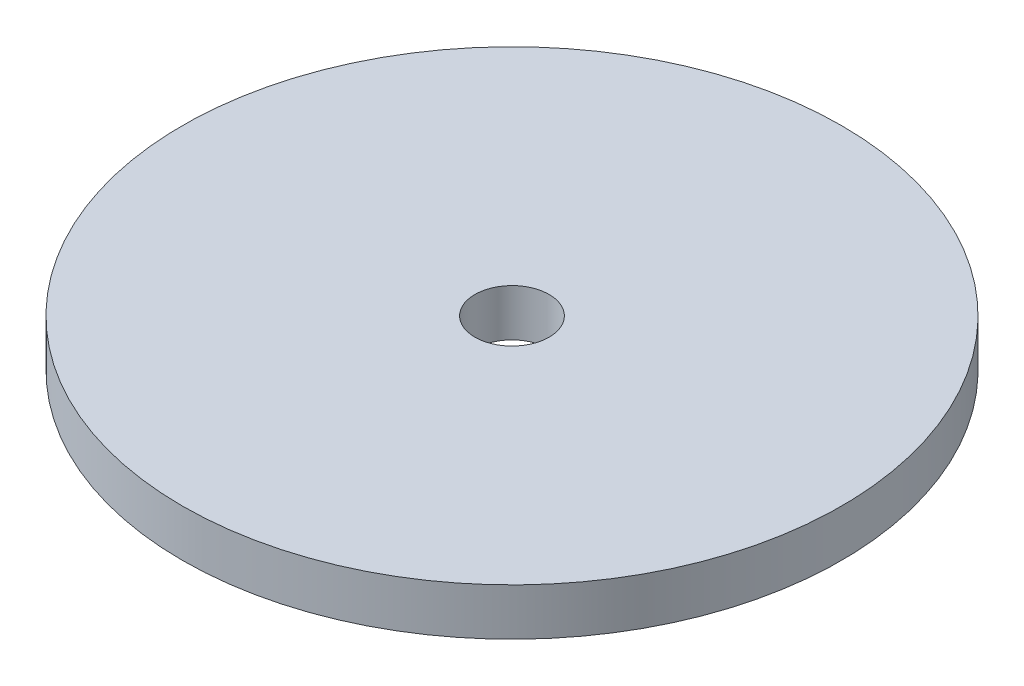
ISO-10303-21;
HEADER;
FILE_DESCRIPTION(('STEP AP214'),'2;1');
FILE_NAME('part.step','',(''),(''),'','','');
FILE_SCHEMA(('AUTOMOTIVE_DESIGN { 1 0 10303 214 1 1 1 1 }'));
ENDSEC;
DATA;
#1=APPLICATION_CONTEXT('core data for automotive mechanical design processes');
#2=APPLICATION_PROTOCOL_DEFINITION('international standard','automotive_design',2000,#1);
#3=PRODUCT_CONTEXT('',#1,'mechanical');
#4=PRODUCT('Part','Part','',(#3));
#5=PRODUCT_RELATED_PRODUCT_CATEGORY('part','',(#4));
#6=PRODUCT_DEFINITION_FORMATION('','',#4);
#7=PRODUCT_DEFINITION_CONTEXT('part definition',#1,'design');
#8=PRODUCT_DEFINITION('design','',#6,#7);
#9=PRODUCT_DEFINITION_SHAPE('','',#8);
#10=(LENGTH_UNIT() NAMED_UNIT(*) SI_UNIT(.MILLI.,.METRE.));
#11=(NAMED_UNIT(*) PLANE_ANGLE_UNIT() SI_UNIT($,.RADIAN.));
#12=(NAMED_UNIT(*) SI_UNIT($,.STERADIAN.) SOLID_ANGLE_UNIT());
#13=UNCERTAINTY_MEASURE_WITH_UNIT(LENGTH_MEASURE(1.E-05),#10,'distance_accuracy_value','');
#14=(GEOMETRIC_REPRESENTATION_CONTEXT(3) GLOBAL_UNCERTAINTY_ASSIGNED_CONTEXT((#13)) GLOBAL_UNIT_ASSIGNED_CONTEXT((#10,
#11,#12)) REPRESENTATION_CONTEXT('',''));
#15=CARTESIAN_POINT('',(0.,0.,0.));
#16=DIRECTION('',(0.,0.,1.));
#17=DIRECTION('',(1.,0.,0.));
#18=AXIS2_PLACEMENT_3D('',#15,#16,#17);
#19=CARTESIAN_POINT('',(0.,6.35,0.));
#20=DIRECTION('',(0.,1.,0.));
#21=DIRECTION('',(0.,0.,1.));
#22=AXIS2_PLACEMENT_3D('',#19,#20,#21);
#23=PLANE('',#22);
#24=CARTESIAN_POINT('',(0.,6.35,0.));
#25=DIRECTION('',(0.,1.,0.));
#26=DIRECTION('',(0.,0.,1.));
#27=AXIS2_PLACEMENT_3D('',#24,#25,#26);
#28=CIRCLE('',#27,44.45);
#29=CARTESIAN_POINT('',(0.,6.35,44.45));
#30=VERTEX_POINT('',#29);
#31=EDGE_CURVE('E10',#30,#30,#28,.T.);
#32=ORIENTED_EDGE('',*,*,#31,.T.);
#33=EDGE_LOOP('',(#32));
#34=FACE_BOUND('',#33,.T.);
#35=CARTESIAN_POINT('',(0.,6.35,0.));
#36=DIRECTION('',(0.,1.,0.));
#37=DIRECTION('',(0.,0.,1.));
#38=AXIS2_PLACEMENT_3D('',#35,#36,#37);
#39=CIRCLE('',#38,5.);
#40=CARTESIAN_POINT('',(0.,6.35,5.));
#41=VERTEX_POINT('',#40);
#42=EDGE_CURVE('E53',#41,#41,#39,.T.);
#43=ORIENTED_EDGE('',*,*,#42,.F.);
#44=EDGE_LOOP('',(#43));
#45=FACE_BOUND('',#44,.T.);
#46=ADVANCED_FACE('F39',(#34,#45),#23,.T.);
#47=CARTESIAN_POINT('',(0.,0.,0.));
#48=DIRECTION('',(0.,1.,0.));
#49=DIRECTION('',(0.,0.,1.));
#50=AXIS2_PLACEMENT_3D('',#47,#48,#49);
#51=PLANE('',#50);
#52=CARTESIAN_POINT('',(0.,0.,0.));
#53=DIRECTION('',(0.,1.,0.));
#54=DIRECTION('',(0.,0.,1.));
#55=AXIS2_PLACEMENT_3D('',#52,#53,#54);
#56=CIRCLE('',#55,44.45);
#57=CARTESIAN_POINT('',(0.,0.,44.45));
#58=VERTEX_POINT('',#57);
#59=EDGE_CURVE('E43',#58,#58,#56,.T.);
#60=ORIENTED_EDGE('',*,*,#59,.F.);
#61=EDGE_LOOP('',(#60));
#62=FACE_BOUND('',#61,.T.);
#63=CARTESIAN_POINT('',(0.,0.,0.));
#64=DIRECTION('',(0.,1.,0.));
#65=DIRECTION('',(0.,0.,1.));
#66=AXIS2_PLACEMENT_3D('',#63,#64,#65);
#67=CIRCLE('',#66,5.);
#68=CARTESIAN_POINT('',(0.,0.,5.));
#69=VERTEX_POINT('',#68);
#70=EDGE_CURVE('E55',#69,#69,#67,.T.);
#71=ORIENTED_EDGE('',*,*,#70,.T.);
#72=EDGE_LOOP('',(#71));
#73=FACE_BOUND('',#72,.T.);
#74=ADVANCED_FACE('F66',(#62,#73),#51,.F.);
#75=CARTESIAN_POINT('',(0.,6.35,0.));
#76=DIRECTION('',(0.,-1.,0.));
#77=DIRECTION('',(0.,0.,-1.));
#78=AXIS2_PLACEMENT_3D('',#75,#76,#77);
#79=CYLINDRICAL_SURFACE('',#78,44.45);
#80=ORIENTED_EDGE('',*,*,#31,.F.);
#81=EDGE_LOOP('',(#80));
#82=FACE_BOUND('',#81,.T.);
#83=ORIENTED_EDGE('',*,*,#59,.T.);
#84=EDGE_LOOP('',(#83));
#85=FACE_BOUND('',#84,.T.);
#86=ADVANCED_FACE('F41',(#82,#85),#79,.T.);
#87=CARTESIAN_POINT('',(0.,6.35,0.));
#88=DIRECTION('',(0.,-1.,0.));
#89=DIRECTION('',(0.,0.,-1.));
#90=AXIS2_PLACEMENT_3D('',#87,#88,#89);
#91=CYLINDRICAL_SURFACE('',#90,5.);
#92=ORIENTED_EDGE('',*,*,#42,.T.);
#93=EDGE_LOOP('',(#92));
#94=FACE_BOUND('',#93,.T.);
#95=ORIENTED_EDGE('',*,*,#70,.F.);
#96=EDGE_LOOP('',(#95));
#97=FACE_BOUND('',#96,.T.);
#98=ADVANCED_FACE('F62',(#94,#97),#91,.F.);
#99=CLOSED_SHELL('',(#46,#74,#86,#98));
#100=MANIFOLD_SOLID_BREP('B2',#99);
#101=ADVANCED_BREP_SHAPE_REPRESENTATION('',(#18,#100),#14);
#102=SHAPE_DEFINITION_REPRESENTATION(#9,#101);
ENDSEC;
END-ISO-10303-21;
